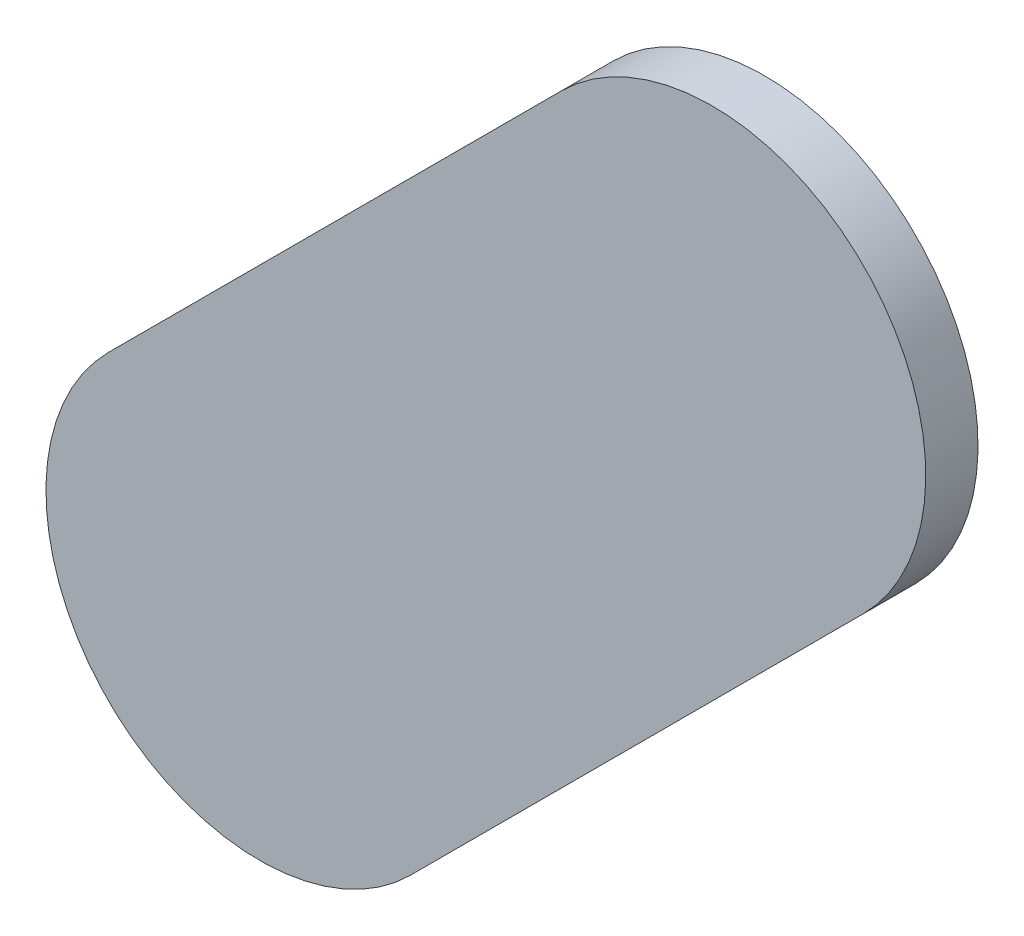
ISO-10303-21;
HEADER;
FILE_DESCRIPTION(('STEP AP214'),'2;1');
FILE_NAME('part.step','',(''),(''),'','','');
FILE_SCHEMA(('AUTOMOTIVE_DESIGN { 1 0 10303 214 1 1 1 1 }'));
ENDSEC;
DATA;
#1=APPLICATION_CONTEXT('core data for automotive mechanical design processes');
#2=APPLICATION_PROTOCOL_DEFINITION('international standard','automotive_design',2000,#1);
#3=PRODUCT_CONTEXT('',#1,'mechanical');
#4=PRODUCT('Part','Part','',(#3));
#5=PRODUCT_RELATED_PRODUCT_CATEGORY('part','',(#4));
#6=PRODUCT_DEFINITION_FORMATION('','',#4);
#7=PRODUCT_DEFINITION_CONTEXT('part definition',#1,'design');
#8=PRODUCT_DEFINITION('design','',#6,#7);
#9=PRODUCT_DEFINITION_SHAPE('','',#8);
#10=(LENGTH_UNIT() NAMED_UNIT(*) SI_UNIT(.MILLI.,.METRE.));
#11=(NAMED_UNIT(*) PLANE_ANGLE_UNIT() SI_UNIT($,.RADIAN.));
#12=(NAMED_UNIT(*) SI_UNIT($,.STERADIAN.) SOLID_ANGLE_UNIT());
#13=UNCERTAINTY_MEASURE_WITH_UNIT(LENGTH_MEASURE(1.E-05),#10,'distance_accuracy_value','');
#14=(GEOMETRIC_REPRESENTATION_CONTEXT(3) GLOBAL_UNCERTAINTY_ASSIGNED_CONTEXT((#13)) GLOBAL_UNIT_ASSIGNED_CONTEXT((#10,
#11,#12)) REPRESENTATION_CONTEXT('',''));
#15=CARTESIAN_POINT('',(0.,0.,0.));
#16=DIRECTION('',(0.,0.,1.));
#17=DIRECTION('',(1.,0.,0.));
#18=AXIS2_PLACEMENT_3D('',#15,#16,#17);
#19=CARTESIAN_POINT('',(2.66537475598,4.213141978031,0.79916));
#20=DIRECTION('',(0.,0.,1.));
#21=DIRECTION('',(1.,0.,0.));
#22=AXIS2_PLACEMENT_3D('',#19,#20,#21);
#23=PLANE('',#22);
#24=CARTESIAN_POINT('',(2.516882,4.064649333,0.79916));
#25=DIRECTION('',(0.,0.,1.));
#26=DIRECTION('',(1.,0.,0.));
#27=AXIS2_PLACEMENT_3D('',#24,#25,#26);
#28=CIRCLE('',#27,0.139999667);
#29=CARTESIAN_POINT('',(2.61587731612217,3.96565465012202,0.79916));
#30=VERTEX_POINT('',#29);
#31=CARTESIAN_POINT('',(2.41788740516728,4.16364416596486,0.79916));
#32=VERTEX_POINT('',#31);
#33=EDGE_CURVE('E20',#30,#32,#28,.F.);
#34=ORIENTED_EDGE('',*,*,#33,.F.);
#35=DIRECTION('',(-0.707106660628037,-0.707106901745037,0.));
#36=VECTOR('',#35,1.);
#37=CARTESIAN_POINT('',(2.912861948866,4.262639384135,0.79916));
#38=LINE('',#37,#36);
#39=CARTESIAN_POINT('',(2.91286212405482,4.26263955932388,0.79916));
#40=VERTEX_POINT('',#39);
#41=EDGE_CURVE('E65',#30,#40,#38,.F.);
#42=ORIENTED_EDGE('',*,*,#41,.T.);
#43=CARTESIAN_POINT('',(2.813867,4.361634434268,0.79916));
#44=DIRECTION('',(0.,0.,1.));
#45=DIRECTION('',(1.,0.,0.));
#46=AXIS2_PLACEMENT_3D('',#43,#44,#45);
#47=CIRCLE('',#46,0.14);
#48=CARTESIAN_POINT('',(2.71487197763338,4.46062931063353,0.79916));
#49=VERTEX_POINT('',#48);
#50=EDGE_CURVE('E57',#49,#40,#47,.F.);
#51=ORIENTED_EDGE('',*,*,#50,.F.);
#52=DIRECTION('',(0.707106099992719,0.707107462379719,0.));
#53=VECTOR('',#52,1.);
#54=CARTESIAN_POINT('',(2.4178876196,4.163644380398,0.79916));
#55=LINE('',#54,#53);
#56=EDGE_CURVE('E64',#49,#32,#55,.F.);
#57=ORIENTED_EDGE('',*,*,#56,.T.);
#58=EDGE_LOOP('',(#34,#42,#51,#57));
#59=FACE_BOUND('',#58,.T.);
#60=ADVANCED_FACE('F17',(#59),#23,.T.);
#61=CARTESIAN_POINT('',(2.912861948866,4.262639384135,0.76487));
#62=DIRECTION('',(-0.707106901745037,0.707106660628037,0.));
#63=DIRECTION('',(-0.707106660628037,-0.707106901745037,0.));
#64=AXIS2_PLACEMENT_3D('',#61,#62,#63);
#65=PLANE('',#64);
#66=DIRECTION('',(0.,0.,1.));
#67=VECTOR('',#66,1.);
#68=CARTESIAN_POINT('',(2.6158773330001,3.9656546669999,0.76487));
#69=LINE('',#68,#67);
#70=CARTESIAN_POINT('',(2.61587731612212,3.96565465012206,0.76487));
#71=VERTEX_POINT('',#70);
#72=EDGE_CURVE('E68',#71,#30,#69,.T.);
#73=ORIENTED_EDGE('',*,*,#72,.F.);
#74=DIRECTION('',(-0.707106660628131,-0.707106901744944,0.));
#75=VECTOR('',#74,1.);
#76=CARTESIAN_POINT('',(2.912861948866,4.262639384135,0.76487));
#77=LINE('',#76,#75);
#78=CARTESIAN_POINT('',(2.91286212405481,4.26263955932387,0.76487));
#79=VERTEX_POINT('',#78);
#80=EDGE_CURVE('E72',#79,#71,#77,.T.);
#81=ORIENTED_EDGE('',*,*,#80,.F.);
#82=DIRECTION('',(0.,0.,1.));
#83=VECTOR('',#82,1.);
#84=CARTESIAN_POINT('',(2.912861948866,4.262639384135,0.76487));
#85=LINE('',#84,#83);
#86=EDGE_CURVE('E60',#40,#79,#85,.F.);
#87=ORIENTED_EDGE('',*,*,#86,.F.);
#88=ORIENTED_EDGE('',*,*,#41,.F.);
#89=EDGE_LOOP('',(#73,#81,#87,#88));
#90=FACE_BOUND('',#89,.T.);
#91=ADVANCED_FACE('F70',(#90),#65,.F.);
#92=CARTESIAN_POINT('',(2.516882,4.064649333,0.76487));
#93=DIRECTION('',(0.,0.,1.));
#94=DIRECTION('',(1.,0.,0.));
#95=AXIS2_PLACEMENT_3D('',#92,#93,#94);
#96=CYLINDRICAL_SURFACE('',#95,0.139999667);
#97=DIRECTION('',(0.,0.,1.));
#98=VECTOR('',#97,1.);
#99=CARTESIAN_POINT('',(2.4178876196,4.163644380398,0.76487));
#100=LINE('',#99,#98);
#101=CARTESIAN_POINT('',(2.41788740516729,4.16364416596488,0.76487));
#102=VERTEX_POINT('',#101);
#103=EDGE_CURVE('E77',#32,#102,#100,.F.);
#104=ORIENTED_EDGE('',*,*,#103,.T.);
#105=CARTESIAN_POINT('',(2.516882333,4.064649565732,0.76487));
#106=DIRECTION('',(0.,0.,1.));
#107=DIRECTION('',(1.,0.,0.));
#108=AXIS2_PLACEMENT_3D('',#105,#106,#107);
#109=CIRCLE('',#108,0.14);
#110=EDGE_CURVE('E26',#71,#102,#109,.F.);
#111=ORIENTED_EDGE('',*,*,#110,.F.);
#112=ORIENTED_EDGE('',*,*,#72,.T.);
#113=ORIENTED_EDGE('',*,*,#33,.T.);
#114=EDGE_LOOP('',(#104,#111,#112,#113));
#115=FACE_BOUND('',#114,.T.);
#116=ADVANCED_FACE('F88',(#115),#96,.T.);
#117=CARTESIAN_POINT('',(2.4178876196,4.163644380398,0.76487));
#118=DIRECTION('',(0.707107462379719,-0.707106099992719,0.));
#119=DIRECTION('',(0.707106099992719,0.707107462379719,0.));
#120=AXIS2_PLACEMENT_3D('',#117,#118,#119);
#121=PLANE('',#120);
#122=DIRECTION('',(0.,0.,1.));
#123=VECTOR('',#122,1.);
#124=CARTESIAN_POINT('',(2.7148719999999,4.4606293330001,0.76487));
#125=LINE('',#124,#123);
#126=CARTESIAN_POINT('',(2.71487197763347,4.46062931063347,0.76487));
#127=VERTEX_POINT('',#126);
#128=EDGE_CURVE('E62',#127,#49,#125,.T.);
#129=ORIENTED_EDGE('',*,*,#128,.F.);
#130=DIRECTION('',(0.707106099992945,0.707107462379493,0.));
#131=VECTOR('',#130,1.);
#132=CARTESIAN_POINT('',(2.4178876196,4.163644380398,0.76487));
#133=LINE('',#132,#131);
#134=EDGE_CURVE('E11',#102,#127,#133,.T.);
#135=ORIENTED_EDGE('',*,*,#134,.F.);
#136=ORIENTED_EDGE('',*,*,#103,.F.);
#137=ORIENTED_EDGE('',*,*,#56,.F.);
#138=EDGE_LOOP('',(#129,#135,#136,#137));
#139=FACE_BOUND('',#138,.T.);
#140=ADVANCED_FACE('F96',(#139),#121,.F.);
#141=CARTESIAN_POINT('',(2.813867,4.361634434268,0.76487));
#142=DIRECTION('',(0.,0.,1.));
#143=DIRECTION('',(1.,0.,0.));
#144=AXIS2_PLACEMENT_3D('',#141,#142,#143);
#145=CYLINDRICAL_SURFACE('',#144,0.14);
#146=CARTESIAN_POINT('',(2.813867333,4.361634667,0.76487));
#147=DIRECTION('',(0.,0.,1.));
#148=DIRECTION('',(1.,0.,0.));
#149=AXIS2_PLACEMENT_3D('',#146,#147,#148);
#150=CIRCLE('',#149,0.14);
#151=EDGE_CURVE('E35',#127,#79,#150,.F.);
#152=ORIENTED_EDGE('',*,*,#151,.F.);
#153=ORIENTED_EDGE('',*,*,#128,.T.);
#154=ORIENTED_EDGE('',*,*,#50,.T.);
#155=ORIENTED_EDGE('',*,*,#86,.T.);
#156=EDGE_LOOP('',(#152,#153,#154,#155));
#157=FACE_BOUND('',#156,.T.);
#158=ADVANCED_FACE('F58',(#157),#145,.T.);
#159=CARTESIAN_POINT('',(2.66537475598,4.213141978031,0.76487));
#160=DIRECTION('',(0.,0.,-1.));
#161=DIRECTION('',(-1.,0.,0.));
#162=AXIS2_PLACEMENT_3D('',#159,#160,#161);
#163=PLANE('',#162);
#164=ORIENTED_EDGE('',*,*,#134,.T.);
#165=ORIENTED_EDGE('',*,*,#151,.T.);
#166=ORIENTED_EDGE('',*,*,#80,.T.);
#167=ORIENTED_EDGE('',*,*,#110,.T.);
#168=EDGE_LOOP('',(#164,#165,#166,#167));
#169=FACE_BOUND('',#168,.T.);
#170=ADVANCED_FACE('F89',(#169),#163,.T.);
#171=CLOSED_SHELL('',(#60,#91,#116,#140,#158,#170));
#172=MANIFOLD_SOLID_BREP('B1',#171);
#173=ADVANCED_BREP_SHAPE_REPRESENTATION('',(#18,#172),#14);
#174=SHAPE_DEFINITION_REPRESENTATION(#9,#173);
ENDSEC;
END-ISO-10303-21;
